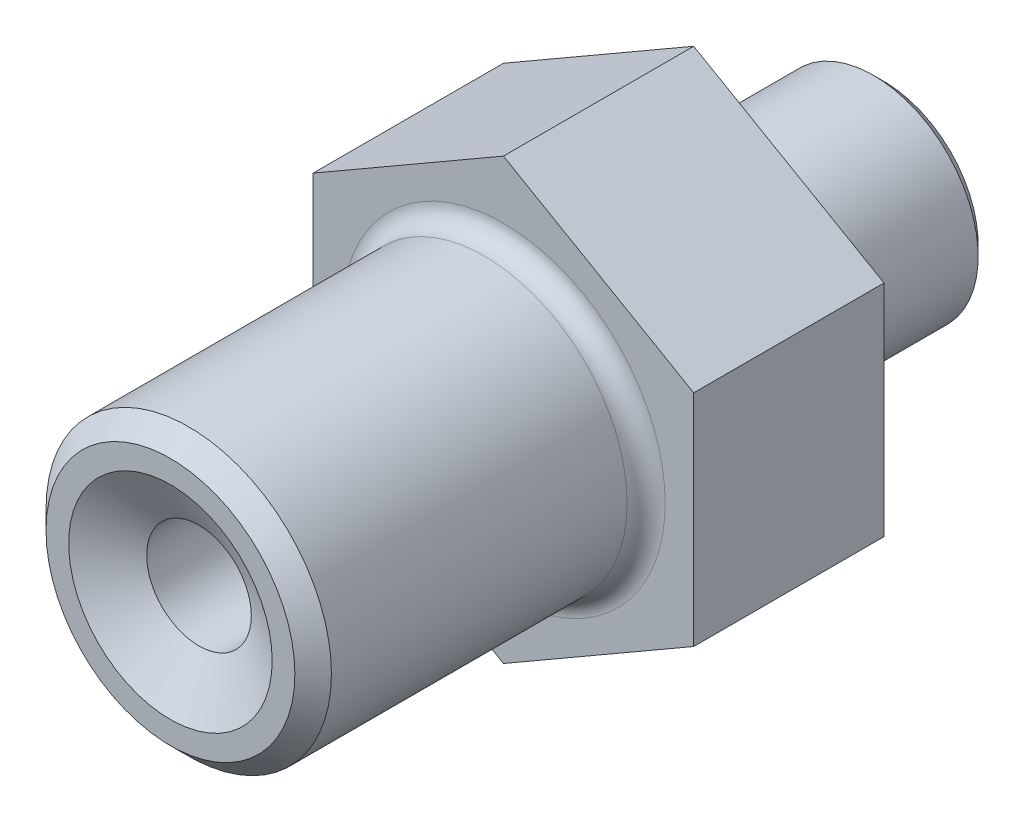
ISO-10303-21;
HEADER;
FILE_DESCRIPTION(('STEP AP214'),'2;1');
FILE_NAME('part.step','',(''),(''),'','','');
FILE_SCHEMA(('AUTOMOTIVE_DESIGN { 1 0 10303 214 1 1 1 1 }'));
ENDSEC;
DATA;
#1=APPLICATION_CONTEXT('core data for automotive mechanical design processes');
#2=APPLICATION_PROTOCOL_DEFINITION('international standard','automotive_design',2000,#1);
#3=PRODUCT_CONTEXT('',#1,'mechanical');
#4=PRODUCT('Part','Part','',(#3));
#5=PRODUCT_RELATED_PRODUCT_CATEGORY('part','',(#4));
#6=PRODUCT_DEFINITION_FORMATION('','',#4);
#7=PRODUCT_DEFINITION_CONTEXT('part definition',#1,'design');
#8=PRODUCT_DEFINITION('design','',#6,#7);
#9=PRODUCT_DEFINITION_SHAPE('','',#8);
#10=(LENGTH_UNIT() NAMED_UNIT(*) SI_UNIT(.MILLI.,.METRE.));
#11=(NAMED_UNIT(*) PLANE_ANGLE_UNIT() SI_UNIT($,.RADIAN.));
#12=(NAMED_UNIT(*) SI_UNIT($,.STERADIAN.) SOLID_ANGLE_UNIT());
#13=UNCERTAINTY_MEASURE_WITH_UNIT(LENGTH_MEASURE(1.E-05),#10,'distance_accuracy_value','');
#14=(GEOMETRIC_REPRESENTATION_CONTEXT(3) GLOBAL_UNCERTAINTY_ASSIGNED_CONTEXT((#13)) GLOBAL_UNIT_ASSIGNED_CONTEXT((#10,
#11,#12)) REPRESENTATION_CONTEXT('',''));
#15=CARTESIAN_POINT('',(0.,0.,0.));
#16=DIRECTION('',(0.,0.,1.));
#17=DIRECTION('',(1.,0.,0.));
#18=AXIS2_PLACEMENT_3D('',#15,#16,#17);
#19=CARTESIAN_POINT('',(0.,0.,55.));
#20=DIRECTION('',(0.,0.,1.));
#21=DIRECTION('',(1.00000000000002,0.,0.));
#22=AXIS2_PLACEMENT_3D('',#19,#20,#21);
#23=PLANE('',#22);
#24=CARTESIAN_POINT('',(0.,0.,55.));
#25=DIRECTION('',(0.,0.,1.));
#26=DIRECTION('',(1.00000000000002,0.,0.));
#27=AXIS2_PLACEMENT_3D('',#24,#25,#26);
#28=CIRCLE('',#27,13.079);
#29=CARTESIAN_POINT('',(13.0790000000002,0.,55.));
#30=VERTEX_POINT('',#29);
#31=EDGE_CURVE('E158',#30,#30,#28,.T.);
#32=ORIENTED_EDGE('',*,*,#31,.T.);
#33=EDGE_LOOP('',(#32));
#34=FACE_BOUND('',#33,.T.);
#35=CARTESIAN_POINT('',(0.,0.,55.));
#36=DIRECTION('',(0.,0.,1.));
#37=DIRECTION('',(1.00000000000002,0.,0.));
#38=AXIS2_PLACEMENT_3D('',#35,#36,#37);
#39=CIRCLE('',#38,10.6961524227067);
#40=CARTESIAN_POINT('',(10.6961524227068,0.,55.));
#41=VERTEX_POINT('',#40);
#42=EDGE_CURVE('E149',#41,#41,#39,.T.);
#43=ORIENTED_EDGE('',*,*,#42,.F.);
#44=EDGE_LOOP('',(#43));
#45=FACE_BOUND('',#44,.T.);
#46=ADVANCED_FACE('F51',(#34,#45),#23,.T.);
#47=CARTESIAN_POINT('',(0.,0.,-20.));
#48=DIRECTION('',(0.,0.,-1.));
#49=DIRECTION('',(-1.00000000000002,0.,0.));
#50=AXIS2_PLACEMENT_3D('',#47,#48,#49);
#51=PLANE('',#50);
#52=CARTESIAN_POINT('',(0.,0.,-20.));
#53=DIRECTION('',(0.,0.,-1.));
#54=DIRECTION('',(-1.00000000000002,0.,0.));
#55=AXIS2_PLACEMENT_3D('',#52,#53,#54);
#56=CIRCLE('',#55,6.65470053837926);
#57=CARTESIAN_POINT('',(-6.65470053837936,0.,-20.));
#58=VERTEX_POINT('',#57);
#59=EDGE_CURVE('E59',#58,#58,#56,.F.);
#60=ORIENTED_EDGE('',*,*,#59,.T.);
#61=EDGE_LOOP('',(#60));
#62=FACE_BOUND('',#61,.T.);
#63=CARTESIAN_POINT('',(0.,0.,-20.));
#64=DIRECTION('',(0.,0.,-1.));
#65=DIRECTION('',(-1.00000000000002,0.,0.));
#66=AXIS2_PLACEMENT_3D('',#63,#64,#65);
#67=CIRCLE('',#66,9.89849999999999);
#68=CARTESIAN_POINT('',(-9.89850000000014,0.,-20.));
#69=VERTEX_POINT('',#68);
#70=EDGE_CURVE('E152',#69,#69,#67,.T.);
#71=ORIENTED_EDGE('',*,*,#70,.T.);
#72=EDGE_LOOP('',(#71));
#73=FACE_BOUND('',#72,.T.);
#74=ADVANCED_FACE('F174',(#62,#73),#51,.T.);
#75=CARTESIAN_POINT('',(0.,0.,0.));
#76=DIRECTION('',(0.,0.,1.));
#77=DIRECTION('',(1.00000000000002,0.,0.));
#78=AXIS2_PLACEMENT_3D('',#75,#76,#77);
#79=PLANE('',#78);
#80=CARTESIAN_POINT('',(0.,0.,0.));
#81=DIRECTION('',(0.,0.,-1.));
#82=DIRECTION('',(-1.00000000000002,0.,0.));
#83=AXIS2_PLACEMENT_3D('',#80,#81,#82);
#84=CIRCLE('',#83,9.5);
#85=CARTESIAN_POINT('',(-9.50000000000014,0.,0.));
#86=VERTEX_POINT('',#85);
#87=EDGE_CURVE('E142',#86,#86,#84,.T.);
#88=ORIENTED_EDGE('',*,*,#87,.F.);
#89=EDGE_LOOP('',(#88));
#90=FACE_BOUND('',#89,.T.);
#91=DIRECTION('',(0.866025403784452,0.500000000000008,0.));
#92=VECTOR('',#91,1.);
#93=CARTESIAN_POINT('',(-20.0000000000003,11.5470053837927,0.));
#94=LINE('',#93,#92);
#95=CARTESIAN_POINT('',(-20.0000000000003,11.5470053837927,0.));
#96=VERTEX_POINT('',#95);
#97=CARTESIAN_POINT('',(0.,23.0940107675854,0.));
#98=VERTEX_POINT('',#97);
#99=EDGE_CURVE('E134',#96,#98,#94,.T.);
#100=ORIENTED_EDGE('',*,*,#99,.T.);
#101=DIRECTION('',(0.866025403784452,-0.500000000000008,0.));
#102=VECTOR('',#101,1.);
#103=CARTESIAN_POINT('',(0.,23.0940107675854,0.));
#104=LINE('',#103,#102);
#105=CARTESIAN_POINT('',(20.0000000000004,11.5470053837927,0.));
#106=VERTEX_POINT('',#105);
#107=EDGE_CURVE('E362',#98,#106,#104,.T.);
#108=ORIENTED_EDGE('',*,*,#107,.T.);
#109=DIRECTION('',(0.,-1.00000000000001,0.));
#110=VECTOR('',#109,1.);
#111=CARTESIAN_POINT('',(20.0000000000004,11.5470053837927,0.));
#112=LINE('',#111,#110);
#113=CARTESIAN_POINT('',(20.0000000000003,-11.5470053837926,0.));
#114=VERTEX_POINT('',#113);
#115=EDGE_CURVE('E376',#106,#114,#112,.T.);
#116=ORIENTED_EDGE('',*,*,#115,.T.);
#117=DIRECTION('',(-0.866025403784452,-0.500000000000007,0.));
#118=VECTOR('',#117,1.);
#119=CARTESIAN_POINT('',(20.0000000000003,-11.5470053837926,0.));
#120=LINE('',#119,#118);
#121=CARTESIAN_POINT('',(0.,-23.0940107675853,0.));
#122=VERTEX_POINT('',#121);
#123=EDGE_CURVE('E373',#114,#122,#120,.T.);
#124=ORIENTED_EDGE('',*,*,#123,.T.);
#125=DIRECTION('',(-0.866025403784452,0.500000000000008,0.));
#126=VECTOR('',#125,1.);
#127=CARTESIAN_POINT('',(0.,-23.0940107675853,0.));
#128=LINE('',#127,#126);
#129=CARTESIAN_POINT('',(-20.,-11.5470053837925,0.));
#130=VERTEX_POINT('',#129);
#131=EDGE_CURVE('E118',#122,#130,#128,.T.);
#132=ORIENTED_EDGE('',*,*,#131,.T.);
#133=DIRECTION('',(0.,1.00000000000001,0.));
#134=VECTOR('',#133,1.);
#135=CARTESIAN_POINT('',(-20.,-11.5470053837925,0.));
#136=LINE('',#135,#134);
#137=EDGE_CURVE('E145',#130,#96,#136,.T.);
#138=ORIENTED_EDGE('',*,*,#137,.T.);
#139=EDGE_LOOP('',(#100,#108,#116,#124,#132,#138));
#140=FACE_BOUND('',#139,.T.);
#141=ADVANCED_FACE('F197',(#90,#140),#79,.F.);
#142=CARTESIAN_POINT('',(0.,0.,20.));
#143=DIRECTION('',(0.,0.,1.));
#144=DIRECTION('',(1.00000000000002,0.,0.));
#145=AXIS2_PLACEMENT_3D('',#142,#143,#144);
#146=PLANE('',#145);
#147=CARTESIAN_POINT('',(0.,0.,20.));
#148=DIRECTION('',(0.,0.,1.));
#149=DIRECTION('',(1.00000000000002,0.,0.));
#150=AXIS2_PLACEMENT_3D('',#147,#148,#149);
#151=CIRCLE('',#150,17.);
#152=CARTESIAN_POINT('',(17.0000000000003,0.,20.));
#153=VERTEX_POINT('',#152);
#154=EDGE_CURVE('E169',#153,#153,#151,.F.);
#155=ORIENTED_EDGE('',*,*,#154,.T.);
#156=EDGE_LOOP('',(#155));
#157=FACE_BOUND('',#156,.T.);
#158=DIRECTION('',(0.866025403784452,0.500000000000008,0.));
#159=VECTOR('',#158,1.);
#160=CARTESIAN_POINT('',(-20.0000000000003,11.5470053837927,20.));
#161=LINE('',#160,#159);
#162=CARTESIAN_POINT('',(-20.0000000000003,11.5470053837927,20.));
#163=VERTEX_POINT('',#162);
#164=CARTESIAN_POINT('',(0.,23.0940107675853,20.));
#165=VERTEX_POINT('',#164);
#166=EDGE_CURVE('E137',#163,#165,#161,.T.);
#167=ORIENTED_EDGE('',*,*,#166,.F.);
#168=DIRECTION('',(0.,1.00000000000001,0.));
#169=VECTOR('',#168,1.);
#170=CARTESIAN_POINT('',(-20.0000000000003,-11.5470053837925,20.));
#171=LINE('',#170,#169);
#172=CARTESIAN_POINT('',(-20.0000000000003,-11.5470053837925,20.));
#173=VERTEX_POINT('',#172);
#174=EDGE_CURVE('E108',#173,#163,#171,.T.);
#175=ORIENTED_EDGE('',*,*,#174,.F.);
#176=DIRECTION('',(-0.866025403784452,0.500000000000007,0.));
#177=VECTOR('',#176,1.);
#178=CARTESIAN_POINT('',(0.,-23.0940107675853,20.));
#179=LINE('',#178,#177);
#180=CARTESIAN_POINT('',(0.,-23.0940107675853,20.));
#181=VERTEX_POINT('',#180);
#182=EDGE_CURVE('E101',#181,#173,#179,.T.);
#183=ORIENTED_EDGE('',*,*,#182,.F.);
#184=DIRECTION('',(-0.866025403784452,-0.500000000000007,0.));
#185=VECTOR('',#184,1.);
#186=CARTESIAN_POINT('',(20.0000000000003,-11.5470053837926,20.));
#187=LINE('',#186,#185);
#188=CARTESIAN_POINT('',(20.0000000000003,-11.5470053837926,20.));
#189=VERTEX_POINT('',#188);
#190=EDGE_CURVE('E105',#189,#181,#187,.T.);
#191=ORIENTED_EDGE('',*,*,#190,.F.);
#192=DIRECTION('',(0.,-1.00000000000001,0.));
#193=VECTOR('',#192,1.);
#194=CARTESIAN_POINT('',(20.0000000000003,11.5470053837927,20.));
#195=LINE('',#194,#193);
#196=CARTESIAN_POINT('',(20.0000000000003,11.5470053837927,20.));
#197=VERTEX_POINT('',#196);
#198=EDGE_CURVE('E72',#197,#189,#195,.T.);
#199=ORIENTED_EDGE('',*,*,#198,.F.);
#200=DIRECTION('',(0.866025403784452,-0.500000000000007,0.));
#201=VECTOR('',#200,1.);
#202=CARTESIAN_POINT('',(0.,23.0940107675853,20.));
#203=LINE('',#202,#201);
#204=EDGE_CURVE('E66',#165,#197,#203,.T.);
#205=ORIENTED_EDGE('',*,*,#204,.F.);
#206=EDGE_LOOP('',(#167,#175,#183,#191,#199,#205));
#207=FACE_BOUND('',#206,.T.);
#208=ADVANCED_FACE('F103',(#157,#207),#146,.T.);
#209=CARTESIAN_POINT('',(0.,0.,55.));
#210=DIRECTION('',(0.,0.,-1.));
#211=DIRECTION('',(-1.00000000000002,0.,0.));
#212=AXIS2_PLACEMENT_3D('',#209,#210,#211);
#213=CYLINDRICAL_SURFACE('',#212,15.);
#214=CARTESIAN_POINT('',(0.,0.,22.));
#215=DIRECTION('',(0.,0.,1.));
#216=DIRECTION('',(1.00000000000002,0.,0.));
#217=AXIS2_PLACEMENT_3D('',#214,#215,#216);
#218=CIRCLE('',#217,15.);
#219=CARTESIAN_POINT('',(15.0000000000002,0.,22.));
#220=VERTEX_POINT('',#219);
#221=EDGE_CURVE('E166',#220,#220,#218,.T.);
#222=ORIENTED_EDGE('',*,*,#221,.T.);
#223=EDGE_LOOP('',(#222));
#224=FACE_BOUND('',#223,.T.);
#225=CARTESIAN_POINT('',(0.,0.,53.079));
#226=DIRECTION('',(0.,0.,1.));
#227=DIRECTION('',(1.00000000000002,0.,0.));
#228=AXIS2_PLACEMENT_3D('',#225,#226,#227);
#229=CIRCLE('',#228,15.);
#230=CARTESIAN_POINT('',(15.0000000000002,0.,53.079));
#231=VERTEX_POINT('',#230);
#232=EDGE_CURVE('E163',#231,#231,#229,.F.);
#233=ORIENTED_EDGE('',*,*,#232,.T.);
#234=EDGE_LOOP('',(#233));
#235=FACE_BOUND('',#234,.T.);
#236=ADVANCED_FACE('F203',(#224,#235),#213,.T.);
#237=CARTESIAN_POINT('',(0.,0.,-20.));
#238=DIRECTION('',(0.,0.,1.));
#239=DIRECTION('',(1.00000000000002,0.,0.));
#240=AXIS2_PLACEMENT_3D('',#237,#238,#239);
#241=CYLINDRICAL_SURFACE('',#240,11.);
#242=CARTESIAN_POINT('',(0.,0.,-2.));
#243=DIRECTION('',(0.,0.,-1.));
#244=DIRECTION('',(-1.00000000000002,0.,0.));
#245=AXIS2_PLACEMENT_3D('',#242,#243,#244);
#246=CIRCLE('',#245,11.);
#247=CARTESIAN_POINT('',(-11.0000000000002,0.,-2.));
#248=VERTEX_POINT('',#247);
#249=EDGE_CURVE('E141',#248,#248,#246,.T.);
#250=ORIENTED_EDGE('',*,*,#249,.T.);
#251=EDGE_LOOP('',(#250));
#252=FACE_BOUND('',#251,.T.);
#253=CARTESIAN_POINT('',(0.,0.,-18.8985));
#254=DIRECTION('',(0.,0.,-1.));
#255=DIRECTION('',(-1.00000000000002,0.,0.));
#256=AXIS2_PLACEMENT_3D('',#253,#254,#255);
#257=CIRCLE('',#256,11.);
#258=CARTESIAN_POINT('',(-11.0000000000002,0.,-18.8985));
#259=VERTEX_POINT('',#258);
#260=EDGE_CURVE('E155',#259,#259,#257,.F.);
#261=ORIENTED_EDGE('',*,*,#260,.T.);
#262=EDGE_LOOP('',(#261));
#263=FACE_BOUND('',#262,.T.);
#264=ADVANCED_FACE('F202',(#252,#263),#241,.T.);
#265=CARTESIAN_POINT('',(0.,0.,52.));
#266=DIRECTION('',(0.,0.,1.));
#267=DIRECTION('',(1.00000000000002,0.,0.));
#268=AXIS2_PLACEMENT_3D('',#265,#266,#267);
#269=CONICAL_SURFACE('',#268,5.5,1.0471975511966);
#270=ORIENTED_EDGE('',*,*,#42,.T.);
#271=EDGE_LOOP('',(#270));
#272=FACE_BOUND('',#271,.T.);
#273=CARTESIAN_POINT('',(0.,0.,52.));
#274=DIRECTION('',(0.,0.,1.));
#275=DIRECTION('',(1.00000000000002,0.,0.));
#276=AXIS2_PLACEMENT_3D('',#273,#274,#275);
#277=CIRCLE('',#276,5.5);
#278=CARTESIAN_POINT('',(5.50000000000009,0.,52.));
#279=VERTEX_POINT('',#278);
#280=EDGE_CURVE('E146',#279,#279,#277,.T.);
#281=ORIENTED_EDGE('',*,*,#280,.F.);
#282=EDGE_LOOP('',(#281));
#283=FACE_BOUND('',#282,.T.);
#284=ADVANCED_FACE('F242',(#272,#283),#269,.F.);
#285=CARTESIAN_POINT('',(0.,0.,55.));
#286=DIRECTION('',(0.,0.,1.));
#287=DIRECTION('',(1.00000000000002,0.,0.));
#288=AXIS2_PLACEMENT_3D('',#285,#286,#287);
#289=CYLINDRICAL_SURFACE('',#288,5.5);
#290=CARTESIAN_POINT('',(0.,0.,-18.));
#291=DIRECTION('',(0.,0.,-1.));
#292=DIRECTION('',(-1.00000000000002,0.,0.));
#293=AXIS2_PLACEMENT_3D('',#290,#291,#292);
#294=CIRCLE('',#293,5.5);
#295=CARTESIAN_POINT('',(-5.50000000000008,0.,-18.));
#296=VERTEX_POINT('',#295);
#297=EDGE_CURVE('E13',#296,#296,#294,.T.);
#298=ORIENTED_EDGE('',*,*,#297,.T.);
#299=EDGE_LOOP('',(#298));
#300=FACE_BOUND('',#299,.T.);
#301=ORIENTED_EDGE('',*,*,#280,.T.);
#302=EDGE_LOOP('',(#301));
#303=FACE_BOUND('',#302,.T.);
#304=ADVANCED_FACE('F217',(#300,#303),#289,.F.);
#305=CARTESIAN_POINT('',(0.,0.,-20.));
#306=DIRECTION('',(0.,0.,1.));
#307=DIRECTION('',(1.00000000000002,0.,0.));
#308=AXIS2_PLACEMENT_3D('',#305,#306,#307);
#309=CONICAL_SURFACE('',#308,9.89849999999999,0.785398163397447);
#310=ORIENTED_EDGE('',*,*,#260,.F.);
#311=EDGE_LOOP('',(#310));
#312=FACE_BOUND('',#311,.T.);
#313=ORIENTED_EDGE('',*,*,#70,.F.);
#314=EDGE_LOOP('',(#313));
#315=FACE_BOUND('',#314,.T.);
#316=ADVANCED_FACE('F213',(#312,#315),#309,.T.);
#317=CARTESIAN_POINT('',(0.,0.,-2.));
#318=DIRECTION('',(0.,0.,-1.));
#319=DIRECTION('',(-1.00000000000002,0.,0.));
#320=AXIS2_PLACEMENT_3D('',#317,#318,#319);
#321=PLANE('',#320);
#322=CARTESIAN_POINT('',(0.,0.,-2.));
#323=DIRECTION('',(0.,0.,-1.));
#324=DIRECTION('',(-1.00000000000002,0.,0.));
#325=AXIS2_PLACEMENT_3D('',#322,#323,#324);
#326=CIRCLE('',#325,9.5);
#327=CARTESIAN_POINT('',(-9.50000000000014,0.,-2.));
#328=VERTEX_POINT('',#327);
#329=EDGE_CURVE('E138',#328,#328,#326,.T.);
#330=ORIENTED_EDGE('',*,*,#329,.T.);
#331=EDGE_LOOP('',(#330));
#332=FACE_BOUND('',#331,.T.);
#333=ORIENTED_EDGE('',*,*,#249,.F.);
#334=EDGE_LOOP('',(#333));
#335=FACE_BOUND('',#334,.T.);
#336=ADVANCED_FACE('F216',(#332,#335),#321,.F.);
#337=CARTESIAN_POINT('',(0.,0.,-2.));
#338=DIRECTION('',(0.,0.,1.));
#339=DIRECTION('',(1.00000000000002,0.,0.));
#340=AXIS2_PLACEMENT_3D('',#337,#338,#339);
#341=CYLINDRICAL_SURFACE('',#340,9.5);
#342=ORIENTED_EDGE('',*,*,#329,.F.);
#343=EDGE_LOOP('',(#342));
#344=FACE_BOUND('',#343,.T.);
#345=ORIENTED_EDGE('',*,*,#87,.T.);
#346=EDGE_LOOP('',(#345));
#347=FACE_BOUND('',#346,.T.);
#348=ADVANCED_FACE('F220',(#344,#347),#341,.T.);
#349=CARTESIAN_POINT('',(0.,0.,55.));
#350=DIRECTION('',(0.,0.,-1.));
#351=DIRECTION('',(-1.00000000000002,0.,0.));
#352=AXIS2_PLACEMENT_3D('',#349,#350,#351);
#353=CONICAL_SURFACE('',#352,13.079,0.785398163397447);
#354=ORIENTED_EDGE('',*,*,#232,.F.);
#355=EDGE_LOOP('',(#354));
#356=FACE_BOUND('',#355,.T.);
#357=ORIENTED_EDGE('',*,*,#31,.F.);
#358=EDGE_LOOP('',(#357));
#359=FACE_BOUND('',#358,.T.);
#360=ADVANCED_FACE('F188',(#356,#359),#353,.T.);
#361=CARTESIAN_POINT('',(0.,0.,22.));
#362=DIRECTION('',(0.,0.,1.));
#363=DIRECTION('',(1.00000000000002,0.,0.));
#364=AXIS2_PLACEMENT_3D('',#361,#362,#363);
#365=TOROIDAL_SURFACE('',#364,17.,2.);
#366=ORIENTED_EDGE('',*,*,#154,.F.);
#367=EDGE_LOOP('',(#366));
#368=FACE_BOUND('',#367,.T.);
#369=ORIENTED_EDGE('',*,*,#221,.F.);
#370=EDGE_LOOP('',(#369));
#371=FACE_BOUND('',#370,.T.);
#372=ADVANCED_FACE('F179',(#368,#371),#365,.F.);
#373=CARTESIAN_POINT('',(0.,0.,-20.));
#374=DIRECTION('',(0.,0.,-1.));
#375=DIRECTION('',(-1.00000000000002,0.,0.));
#376=AXIS2_PLACEMENT_3D('',#373,#374,#375);
#377=CONICAL_SURFACE('',#376,6.65470053837926,0.523598775598295);
#378=ORIENTED_EDGE('',*,*,#297,.F.);
#379=EDGE_LOOP('',(#378));
#380=FACE_BOUND('',#379,.T.);
#381=ORIENTED_EDGE('',*,*,#59,.F.);
#382=EDGE_LOOP('',(#381));
#383=FACE_BOUND('',#382,.T.);
#384=ADVANCED_FACE('F53',(#380,#383),#377,.F.);
#385=CARTESIAN_POINT('',(-20.0000000000003,11.5470053837927,81.1010092660779));
#386=DIRECTION('',(-0.500000000000008,0.866025403784452,0.));
#387=DIRECTION('',(-0.866025403784452,-0.500000000000008,0.));
#388=AXIS2_PLACEMENT_3D('',#385,#386,#387);
#389=PLANE('',#388);
#390=DIRECTION('',(0.,0.,-1.));
#391=VECTOR('',#390,1.);
#392=CARTESIAN_POINT('',(-20.0000000000003,11.5470053837927,81.1010092660779));
#393=LINE('',#392,#391);
#394=EDGE_CURVE('E112',#163,#96,#393,.T.);
#395=ORIENTED_EDGE('',*,*,#394,.F.);
#396=ORIENTED_EDGE('',*,*,#166,.T.);
#397=DIRECTION('',(0.,0.,-1.));
#398=VECTOR('',#397,1.);
#399=CARTESIAN_POINT('',(0.,23.0940107675854,81.1010092660779));
#400=LINE('',#399,#398);
#401=EDGE_CURVE('E135',#165,#98,#400,.T.);
#402=ORIENTED_EDGE('',*,*,#401,.T.);
#403=ORIENTED_EDGE('',*,*,#99,.F.);
#404=EDGE_LOOP('',(#395,#396,#402,#403));
#405=FACE_BOUND('',#404,.T.);
#406=ADVANCED_FACE('F178',(#405),#389,.T.);
#407=CARTESIAN_POINT('',(-20.,-11.5470053837925,81.1010092660779));
#408=DIRECTION('',(-1.00000000000001,0.,0.));
#409=DIRECTION('',(0.,-1.00000000000001,0.));
#410=AXIS2_PLACEMENT_3D('',#407,#408,#409);
#411=PLANE('',#410);
#412=DIRECTION('',(0.,0.,-1.));
#413=VECTOR('',#412,1.);
#414=CARTESIAN_POINT('',(-20.,-11.5470053837925,81.1010092660779));
#415=LINE('',#414,#413);
#416=EDGE_CURVE('E111',#173,#130,#415,.T.);
#417=ORIENTED_EDGE('',*,*,#416,.F.);
#418=ORIENTED_EDGE('',*,*,#174,.T.);
#419=ORIENTED_EDGE('',*,*,#394,.T.);
#420=ORIENTED_EDGE('',*,*,#137,.F.);
#421=EDGE_LOOP('',(#417,#418,#419,#420));
#422=FACE_BOUND('',#421,.T.);
#423=ADVANCED_FACE('F185',(#422),#411,.T.);
#424=CARTESIAN_POINT('',(0.,-23.0940107675852,81.1010092660779));
#425=DIRECTION('',(-0.500000000000007,-0.866025403784452,0.));
#426=DIRECTION('',(0.866025403784452,-0.500000000000007,0.));
#427=AXIS2_PLACEMENT_3D('',#424,#425,#426);
#428=PLANE('',#427);
#429=DIRECTION('',(0.,0.,-1.));
#430=VECTOR('',#429,1.);
#431=CARTESIAN_POINT('',(0.,-23.0940107675852,81.1010092660779));
#432=LINE('',#431,#430);
#433=EDGE_CURVE('E115',#181,#122,#432,.T.);
#434=ORIENTED_EDGE('',*,*,#433,.F.);
#435=ORIENTED_EDGE('',*,*,#182,.T.);
#436=ORIENTED_EDGE('',*,*,#416,.T.);
#437=ORIENTED_EDGE('',*,*,#131,.F.);
#438=EDGE_LOOP('',(#434,#435,#436,#437));
#439=FACE_BOUND('',#438,.T.);
#440=ADVANCED_FACE('F116',(#439),#428,.T.);
#441=CARTESIAN_POINT('',(20.0000000000003,-11.5470053837926,81.1010092660779));
#442=DIRECTION('',(0.500000000000007,-0.866025403784452,0.));
#443=DIRECTION('',(0.866025403784452,0.500000000000007,0.));
#444=AXIS2_PLACEMENT_3D('',#441,#442,#443);
#445=PLANE('',#444);
#446=DIRECTION('',(0.,0.,-1.));
#447=VECTOR('',#446,1.);
#448=CARTESIAN_POINT('',(20.0000000000003,-11.5470053837926,81.1010092660779));
#449=LINE('',#448,#447);
#450=EDGE_CURVE('E124',#189,#114,#449,.T.);
#451=ORIENTED_EDGE('',*,*,#450,.F.);
#452=ORIENTED_EDGE('',*,*,#190,.T.);
#453=ORIENTED_EDGE('',*,*,#433,.T.);
#454=ORIENTED_EDGE('',*,*,#123,.F.);
#455=EDGE_LOOP('',(#451,#452,#453,#454));
#456=FACE_BOUND('',#455,.T.);
#457=ADVANCED_FACE('F123',(#456),#445,.T.);
#458=CARTESIAN_POINT('',(20.0000000000005,11.5470053837927,81.1010092660779));
#459=DIRECTION('',(1.00000000000001,0.,0.));
#460=DIRECTION('',(0.,1.00000000000001,0.));
#461=AXIS2_PLACEMENT_3D('',#458,#459,#460);
#462=PLANE('',#461);
#463=DIRECTION('',(0.,0.,-1.));
#464=VECTOR('',#463,1.);
#465=CARTESIAN_POINT('',(20.0000000000005,11.5470053837927,81.1010092660779));
#466=LINE('',#465,#464);
#467=EDGE_CURVE('E132',#197,#106,#466,.T.);
#468=ORIENTED_EDGE('',*,*,#467,.F.);
#469=ORIENTED_EDGE('',*,*,#198,.T.);
#470=ORIENTED_EDGE('',*,*,#450,.T.);
#471=ORIENTED_EDGE('',*,*,#115,.F.);
#472=EDGE_LOOP('',(#468,#469,#470,#471));
#473=FACE_BOUND('',#472,.T.);
#474=ADVANCED_FACE('F342',(#473),#462,.T.);
#475=CARTESIAN_POINT('',(0.,23.0940107675854,81.1010092660779));
#476=DIRECTION('',(0.500000000000007,0.866025403784452,0.));
#477=DIRECTION('',(-0.866025403784452,0.500000000000007,0.));
#478=AXIS2_PLACEMENT_3D('',#475,#476,#477);
#479=PLANE('',#478);
#480=ORIENTED_EDGE('',*,*,#401,.F.);
#481=ORIENTED_EDGE('',*,*,#204,.T.);
#482=ORIENTED_EDGE('',*,*,#467,.T.);
#483=ORIENTED_EDGE('',*,*,#107,.F.);
#484=EDGE_LOOP('',(#480,#481,#482,#483));
#485=FACE_BOUND('',#484,.T.);
#486=ADVANCED_FACE('F349',(#485),#479,.T.);
#487=CLOSED_SHELL('',(#46,#74,#141,#208,#236,#264,#284,#304,#316,#336,#348,#360,#372,#384,#406,
#423,#440,#457,#474,#486));
#488=MANIFOLD_SOLID_BREP('B2',#487);
#489=ADVANCED_BREP_SHAPE_REPRESENTATION('',(#18,#488),#14);
#490=SHAPE_DEFINITION_REPRESENTATION(#9,#489);
ENDSEC;
END-ISO-10303-21;
